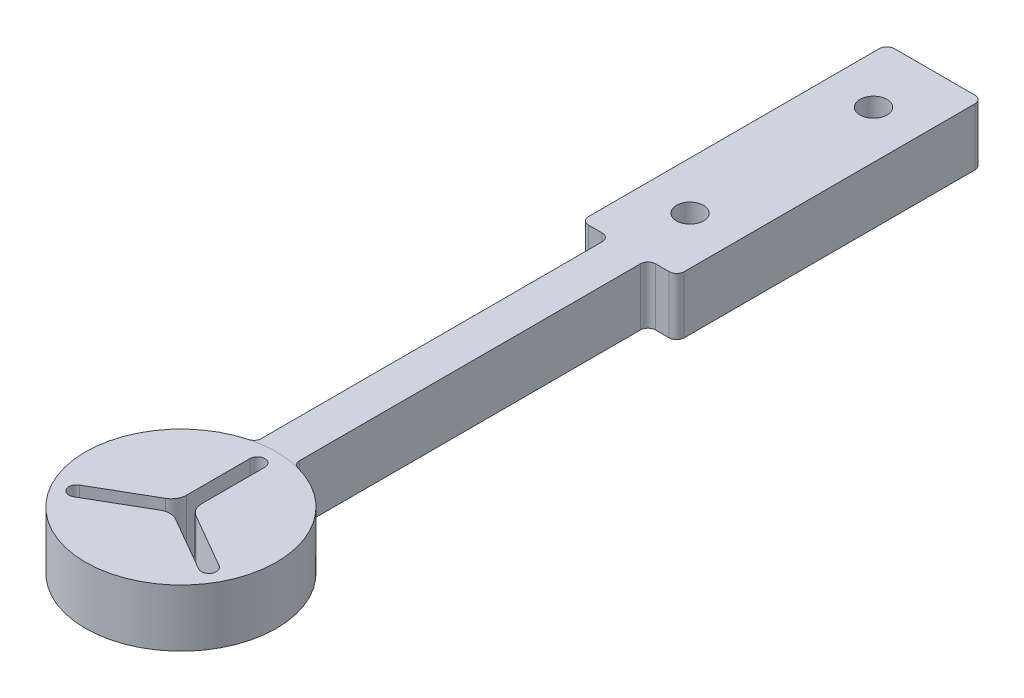
ISO-10303-21;
HEADER;
FILE_DESCRIPTION(('STEP AP214'),'2;1');
FILE_NAME('part.step','',(''),(''),'','','');
FILE_SCHEMA(('AUTOMOTIVE_DESIGN { 1 0 10303 214 1 1 1 1 }'));
ENDSEC;
DATA;
#1=APPLICATION_CONTEXT('core data for automotive mechanical design processes');
#2=APPLICATION_PROTOCOL_DEFINITION('international standard','automotive_design',2000,#1);
#3=PRODUCT_CONTEXT('',#1,'mechanical');
#4=PRODUCT('Part','Part','',(#3));
#5=PRODUCT_RELATED_PRODUCT_CATEGORY('part','',(#4));
#6=PRODUCT_DEFINITION_FORMATION('','',#4);
#7=PRODUCT_DEFINITION_CONTEXT('part definition',#1,'design');
#8=PRODUCT_DEFINITION('design','',#6,#7);
#9=PRODUCT_DEFINITION_SHAPE('','',#8);
#10=(LENGTH_UNIT() NAMED_UNIT(*) SI_UNIT(.MILLI.,.METRE.));
#11=(NAMED_UNIT(*) PLANE_ANGLE_UNIT() SI_UNIT($,.RADIAN.));
#12=(NAMED_UNIT(*) SI_UNIT($,.STERADIAN.) SOLID_ANGLE_UNIT());
#13=UNCERTAINTY_MEASURE_WITH_UNIT(LENGTH_MEASURE(1.E-05),#10,'distance_accuracy_value','');
#14=(GEOMETRIC_REPRESENTATION_CONTEXT(3) GLOBAL_UNCERTAINTY_ASSIGNED_CONTEXT((#13)) GLOBAL_UNIT_ASSIGNED_CONTEXT((#10,
#11,#12)) REPRESENTATION_CONTEXT('',''));
#15=CARTESIAN_POINT('',(0.,0.,0.));
#16=DIRECTION('',(0.,0.,1.));
#17=DIRECTION('',(1.,0.,0.));
#18=AXIS2_PLACEMENT_3D('',#15,#16,#17);
#19=CARTESIAN_POINT('',(0.,9.525,74.422));
#20=DIRECTION('',(0.,1.,0.));
#21=DIRECTION('',(0.,0.,1.));
#22=AXIS2_PLACEMENT_3D('',#19,#20,#21);
#23=PLANE('',#22);
#24=CARTESIAN_POINT('',(0.,9.525,-40.64));
#25=DIRECTION('',(0.,1.,0.));
#26=DIRECTION('',(0.,0.,1.));
#27=AXIS2_PLACEMENT_3D('',#24,#25,#26);
#28=CIRCLE('',#27,2.2479);
#29=CARTESIAN_POINT('',(0.,9.525,-38.3921));
#30=VERTEX_POINT('',#29);
#31=EDGE_CURVE('E302',#30,#30,#28,.T.);
#32=ORIENTED_EDGE('',*,*,#31,.F.);
#33=EDGE_LOOP('',(#32));
#34=FACE_BOUND('',#33,.T.);
#35=CARTESIAN_POINT('',(0.,9.525,-10.16));
#36=DIRECTION('',(0.,1.,0.));
#37=DIRECTION('',(0.,0.,1.));
#38=AXIS2_PLACEMENT_3D('',#35,#36,#37);
#39=CIRCLE('',#38,2.2479);
#40=CARTESIAN_POINT('',(0.,9.525,-7.9121));
#41=VERTEX_POINT('',#40);
#42=EDGE_CURVE('E289',#41,#41,#39,.T.);
#43=ORIENTED_EDGE('',*,*,#42,.F.);
#44=EDGE_LOOP('',(#43));
#45=FACE_BOUND('',#44,.T.);
#46=CARTESIAN_POINT('',(-4.42499999999999,9.525,57.8785723019684));
#47=DIRECTION('',(0.,1.,0.));
#48=DIRECTION('',(0.,0.,1.));
#49=AXIS2_PLACEMENT_3D('',#46,#47,#48);
#50=CIRCLE('',#49,1.25);
#51=CARTESIAN_POINT('',(-3.17499999999999,9.525,57.8785723019684));
#52=VERTEX_POINT('',#51);
#53=CARTESIAN_POINT('',(-4.10200729927006,9.525,59.086121768978));
#54=VERTEX_POINT('',#53);
#55=EDGE_CURVE('E430',#52,#54,#50,.F.);
#56=ORIENTED_EDGE('',*,*,#55,.T.);
#57=CARTESIAN_POINT('',(0.,9.525,74.422));
#58=DIRECTION('',(0.,1.,0.));
#59=DIRECTION('',(0.,0.,1.));
#60=AXIS2_PLACEMENT_3D('',#57,#58,#59);
#61=CIRCLE('',#60,15.875);
#62=CARTESIAN_POINT('',(4.10200729927008,9.525,59.086121768978));
#63=VERTEX_POINT('',#62);
#64=EDGE_CURVE('E436',#54,#63,#61,.F.);
#65=ORIENTED_EDGE('',*,*,#64,.T.);
#66=CARTESIAN_POINT('',(4.42500000000001,9.525,57.8785723019684));
#67=DIRECTION('',(0.,1.,0.));
#68=DIRECTION('',(0.,0.,1.));
#69=AXIS2_PLACEMENT_3D('',#66,#67,#68);
#70=CIRCLE('',#69,1.25);
#71=CARTESIAN_POINT('',(3.17500000000001,9.525,57.8785723019684));
#72=VERTEX_POINT('',#71);
#73=EDGE_CURVE('E426',#63,#72,#70,.F.);
#74=ORIENTED_EDGE('',*,*,#73,.T.);
#75=DIRECTION('',(0.,0.,-1.));
#76=VECTOR('',#75,1.);
#77=CARTESIAN_POINT('',(3.175,9.525,0.));
#78=LINE('',#77,#76);
#79=CARTESIAN_POINT('',(3.175,9.525,1.25));
#80=VERTEX_POINT('',#79);
#81=EDGE_CURVE('E324',#72,#80,#78,.T.);
#82=ORIENTED_EDGE('',*,*,#81,.T.);
#83=CARTESIAN_POINT('',(4.425,9.525,1.25));
#84=DIRECTION('',(0.,1.,0.));
#85=DIRECTION('',(0.,0.,1.));
#86=AXIS2_PLACEMENT_3D('',#83,#84,#85);
#87=CIRCLE('',#86,1.25);
#88=CARTESIAN_POINT('',(4.425,9.525,0.));
#89=VERTEX_POINT('',#88);
#90=EDGE_CURVE('E422',#80,#89,#87,.F.);
#91=ORIENTED_EDGE('',*,*,#90,.T.);
#92=DIRECTION('',(1.,0.,0.));
#93=VECTOR('',#92,1.);
#94=CARTESIAN_POINT('',(3.175,9.525,0.));
#95=LINE('',#94,#93);
#96=CARTESIAN_POINT('',(6.6875,9.525,0.));
#97=VERTEX_POINT('',#96);
#98=EDGE_CURVE('E327',#89,#97,#95,.T.);
#99=ORIENTED_EDGE('',*,*,#98,.T.);
#100=CARTESIAN_POINT('',(6.6875,9.525,-1.25));
#101=DIRECTION('',(0.,1.,0.));
#102=DIRECTION('',(0.,0.,1.));
#103=AXIS2_PLACEMENT_3D('',#100,#101,#102);
#104=CIRCLE('',#103,1.25);
#105=CARTESIAN_POINT('',(7.9375,9.525,-1.25));
#106=VERTEX_POINT('',#105);
#107=EDGE_CURVE('E376',#97,#106,#104,.T.);
#108=ORIENTED_EDGE('',*,*,#107,.T.);
#109=DIRECTION('',(0.,0.,-1.));
#110=VECTOR('',#109,1.);
#111=CARTESIAN_POINT('',(7.9375,9.525,-50.8));
#112=LINE('',#111,#110);
#113=CARTESIAN_POINT('',(7.9375,9.525,-49.55));
#114=VERTEX_POINT('',#113);
#115=EDGE_CURVE('E330',#106,#114,#112,.T.);
#116=ORIENTED_EDGE('',*,*,#115,.T.);
#117=CARTESIAN_POINT('',(6.6875,9.525,-49.55));
#118=DIRECTION('',(0.,1.,0.));
#119=DIRECTION('',(0.,0.,1.));
#120=AXIS2_PLACEMENT_3D('',#117,#118,#119);
#121=CIRCLE('',#120,1.25);
#122=CARTESIAN_POINT('',(6.6875,9.525,-50.8));
#123=VERTEX_POINT('',#122);
#124=EDGE_CURVE('E382',#114,#123,#121,.T.);
#125=ORIENTED_EDGE('',*,*,#124,.T.);
#126=DIRECTION('',(-1.,0.,0.));
#127=VECTOR('',#126,1.);
#128=CARTESIAN_POINT('',(-7.9375,9.525,-50.8));
#129=LINE('',#128,#127);
#130=CARTESIAN_POINT('',(-6.6875,9.525,-50.8));
#131=VERTEX_POINT('',#130);
#132=EDGE_CURVE('E333',#123,#131,#129,.T.);
#133=ORIENTED_EDGE('',*,*,#132,.T.);
#134=CARTESIAN_POINT('',(-6.6875,9.525,-49.55));
#135=DIRECTION('',(0.,1.,0.));
#136=DIRECTION('',(0.,0.,1.));
#137=AXIS2_PLACEMENT_3D('',#134,#135,#136);
#138=CIRCLE('',#137,1.25);
#139=CARTESIAN_POINT('',(-7.9375,9.525,-49.55));
#140=VERTEX_POINT('',#139);
#141=EDGE_CURVE('E380',#131,#140,#138,.T.);
#142=ORIENTED_EDGE('',*,*,#141,.T.);
#143=DIRECTION('',(0.,0.,1.));
#144=VECTOR('',#143,1.);
#145=CARTESIAN_POINT('',(-7.9375,9.525,-50.8));
#146=LINE('',#145,#144);
#147=CARTESIAN_POINT('',(-7.93749999999999,9.525,-1.25));
#148=VERTEX_POINT('',#147);
#149=EDGE_CURVE('E311',#140,#148,#146,.T.);
#150=ORIENTED_EDGE('',*,*,#149,.T.);
#151=CARTESIAN_POINT('',(-6.68749999999999,9.525,-1.25));
#152=DIRECTION('',(0.,1.,0.));
#153=DIRECTION('',(0.,0.,1.));
#154=AXIS2_PLACEMENT_3D('',#151,#152,#153);
#155=CIRCLE('',#154,1.25);
#156=CARTESIAN_POINT('',(-6.68749999999999,9.525,0.));
#157=VERTEX_POINT('',#156);
#158=EDGE_CURVE('E378',#148,#157,#155,.T.);
#159=ORIENTED_EDGE('',*,*,#158,.T.);
#160=DIRECTION('',(1.,0.,0.));
#161=VECTOR('',#160,1.);
#162=CARTESIAN_POINT('',(-7.93749999999999,9.525,0.));
#163=LINE('',#162,#161);
#164=CARTESIAN_POINT('',(-4.425,9.525,0.));
#165=VERTEX_POINT('',#164);
#166=EDGE_CURVE('E314',#157,#165,#163,.T.);
#167=ORIENTED_EDGE('',*,*,#166,.T.);
#168=CARTESIAN_POINT('',(-4.425,9.525,1.25));
#169=DIRECTION('',(0.,1.,0.));
#170=DIRECTION('',(0.,0.,1.));
#171=AXIS2_PLACEMENT_3D('',#168,#169,#170);
#172=CIRCLE('',#171,1.25);
#173=CARTESIAN_POINT('',(-3.175,9.525,1.25));
#174=VERTEX_POINT('',#173);
#175=EDGE_CURVE('E418',#165,#174,#172,.F.);
#176=ORIENTED_EDGE('',*,*,#175,.T.);
#177=DIRECTION('',(0.,0.,1.));
#178=VECTOR('',#177,1.);
#179=CARTESIAN_POINT('',(-3.175,9.525,0.));
#180=LINE('',#179,#178);
#181=EDGE_CURVE('E318',#174,#52,#180,.T.);
#182=ORIENTED_EDGE('',*,*,#181,.T.);
#183=EDGE_LOOP('',(#56,#65,#74,#82,#91,#99,#108,#116,#125,#133,#142,#150,#159,#167,#176,#182));
#184=FACE_BOUND('',#183,.T.);
#185=ADVANCED_FACE('F39',(#34,#45,#184),#23,.T.);
#186=CARTESIAN_POINT('',(0.,0.,74.422));
#187=DIRECTION('',(0.,1.,0.));
#188=DIRECTION('',(0.,0.,1.));
#189=AXIS2_PLACEMENT_3D('',#186,#187,#188);
#190=PLANE('',#189);
#191=DIRECTION('',(0.866025403784443,0.,-0.499999999999992));
#192=VECTOR('',#191,1.);
#193=CARTESIAN_POINT('',(2.79615740284012E-13,0.,75.8591402900668));
#194=LINE('',#193,#192);
#195=CARTESIAN_POINT('',(-10.3762226280623,0.,81.8498552175501));
#196=VERTEX_POINT('',#195);
#197=CARTESIAN_POINT('',(-1.26999999999972,0.,76.5923751319376));
#198=VERTEX_POINT('',#197);
#199=EDGE_CURVE('E259',#196,#198,#194,.T.);
#200=ORIENTED_EDGE('',*,*,#199,.T.);
#201=CARTESIAN_POINT('',(2.55654872272082E-13,0.,78.7920796575501));
#202=DIRECTION('',(0.,1.,0.));
#203=DIRECTION('',(0.,0.,1.));
#204=AXIS2_PLACEMENT_3D('',#201,#202,#203);
#205=CIRCLE('',#204,2.54);
#206=CARTESIAN_POINT('',(1.27000000000026,0.,76.5923751319376));
#207=VERTEX_POINT('',#206);
#208=EDGE_CURVE('E452',#198,#207,#205,.F.);
#209=ORIENTED_EDGE('',*,*,#208,.T.);
#210=DIRECTION('',(0.866025403784436,0.,0.500000000000004));
#211=VECTOR('',#210,1.);
#212=CARTESIAN_POINT('',(2.79615740284012E-13,0.,75.8591402900668));
#213=LINE('',#212,#211);
#214=CARTESIAN_POINT('',(10.3762226280625,0.,81.8498552175501));
#215=VERTEX_POINT('',#214);
#216=EDGE_CURVE('E261',#207,#215,#213,.T.);
#217=ORIENTED_EDGE('',*,*,#216,.T.);
#218=CARTESIAN_POINT('',(10.9985226280625,0.,80.772));
#219=DIRECTION('',(0.,1.,0.));
#220=DIRECTION('',(0.,0.,-1.));
#221=AXIS2_PLACEMENT_3D('',#218,#219,#220);
#222=CIRCLE('',#221,1.2446);
#223=CARTESIAN_POINT('',(11.6208226280625,0.,79.6941447824499));
#224=VERTEX_POINT('',#223);
#225=EDGE_CURVE('E263',#215,#224,#222,.T.);
#226=ORIENTED_EDGE('',*,*,#225,.T.);
#227=DIRECTION('',(-0.866025403784436,0.,-0.500000000000005));
#228=VECTOR('',#227,1.);
#229=CARTESIAN_POINT('',(1.2446,0.,73.7034298549664));
#230=LINE('',#229,#228);
#231=CARTESIAN_POINT('',(2.51459999999998,0.,74.4366646968373));
#232=VERTEX_POINT('',#231);
#233=EDGE_CURVE('E246',#224,#232,#230,.T.);
#234=ORIENTED_EDGE('',*,*,#233,.T.);
#235=CARTESIAN_POINT('',(3.7846,0.,72.2369601712248));
#236=DIRECTION('',(0.,1.,0.));
#237=DIRECTION('',(0.,0.,1.));
#238=AXIS2_PLACEMENT_3D('',#235,#236,#237);
#239=CIRCLE('',#238,2.54);
#240=CARTESIAN_POINT('',(1.2446,0.,72.2369601712248));
#241=VERTEX_POINT('',#240);
#242=EDGE_CURVE('E231',#232,#241,#239,.F.);
#243=ORIENTED_EDGE('',*,*,#242,.T.);
#244=DIRECTION('',(0.,0.,-1.));
#245=VECTOR('',#244,1.);
#246=CARTESIAN_POINT('',(1.2446,0.,73.7034298549664));
#247=LINE('',#246,#245);
#248=CARTESIAN_POINT('',(1.2446,0.,61.722));
#249=VERTEX_POINT('',#248);
#250=EDGE_CURVE('E222',#241,#249,#247,.T.);
#251=ORIENTED_EDGE('',*,*,#250,.T.);
#252=CARTESIAN_POINT('',(0.,0.,61.722));
#253=DIRECTION('',(0.,1.,0.));
#254=DIRECTION('',(0.,0.,-1.));
#255=AXIS2_PLACEMENT_3D('',#252,#253,#254);
#256=CIRCLE('',#255,1.2446);
#257=CARTESIAN_POINT('',(-1.2446,0.,61.722));
#258=VERTEX_POINT('',#257);
#259=EDGE_CURVE('E228',#249,#258,#256,.T.);
#260=ORIENTED_EDGE('',*,*,#259,.T.);
#261=DIRECTION('',(0.,0.,1.));
#262=VECTOR('',#261,1.);
#263=CARTESIAN_POINT('',(-1.2446,0.,73.7034298549668));
#264=LINE('',#263,#262);
#265=CARTESIAN_POINT('',(-1.2446,0.,72.2369601712251));
#266=VERTEX_POINT('',#265);
#267=EDGE_CURVE('E250',#258,#266,#264,.T.);
#268=ORIENTED_EDGE('',*,*,#267,.T.);
#269=CARTESIAN_POINT('',(-3.7846,0.,72.2369601712251));
#270=DIRECTION('',(0.,1.,0.));
#271=DIRECTION('',(0.,0.,1.));
#272=AXIS2_PLACEMENT_3D('',#269,#270,#271);
#273=CIRCLE('',#272,2.54);
#274=CARTESIAN_POINT('',(-2.51460000000002,0.,74.4366646968376));
#275=VERTEX_POINT('',#274);
#276=EDGE_CURVE('E54',#266,#275,#273,.F.);
#277=ORIENTED_EDGE('',*,*,#276,.T.);
#278=DIRECTION('',(-0.866025403784443,0.,0.499999999999992));
#279=VECTOR('',#278,1.);
#280=CARTESIAN_POINT('',(-1.2446,0.,73.7034298549668));
#281=LINE('',#280,#279);
#282=CARTESIAN_POINT('',(-11.6208226280623,0.,79.6941447824499));
#283=VERTEX_POINT('',#282);
#284=EDGE_CURVE('E252',#275,#283,#281,.T.);
#285=ORIENTED_EDGE('',*,*,#284,.T.);
#286=CARTESIAN_POINT('',(-10.9985226280623,0.,80.772));
#287=DIRECTION('',(0.,1.,0.));
#288=DIRECTION('',(0.,0.,-1.));
#289=AXIS2_PLACEMENT_3D('',#286,#287,#288);
#290=CIRCLE('',#289,1.2446);
#291=EDGE_CURVE('E256',#283,#196,#290,.T.);
#292=ORIENTED_EDGE('',*,*,#291,.T.);
#293=EDGE_LOOP('',(#200,#209,#217,#226,#234,#243,#251,#260,#268,#277,#285,#292));
#294=FACE_BOUND('',#293,.T.);
#295=DIRECTION('',(-1.,0.,0.));
#296=VECTOR('',#295,1.);
#297=CARTESIAN_POINT('',(0.,0.,0.));
#298=LINE('',#297,#296);
#299=CARTESIAN_POINT('',(4.425,0.,0.));
#300=VERTEX_POINT('',#299);
#301=CARTESIAN_POINT('',(-4.425,0.,0.));
#302=VERTEX_POINT('',#301);
#303=EDGE_CURVE('E433',#300,#302,#298,.T.);
#304=ORIENTED_EDGE('',*,*,#303,.F.);
#305=CARTESIAN_POINT('',(4.425,0.,1.25));
#306=DIRECTION('',(0.,1.,0.));
#307=DIRECTION('',(0.,0.,1.));
#308=AXIS2_PLACEMENT_3D('',#305,#306,#307);
#309=CIRCLE('',#308,1.25);
#310=CARTESIAN_POINT('',(3.175,0.,1.25));
#311=VERTEX_POINT('',#310);
#312=EDGE_CURVE('E420',#300,#311,#309,.T.);
#313=ORIENTED_EDGE('',*,*,#312,.T.);
#314=DIRECTION('',(0.,0.,-1.));
#315=VECTOR('',#314,1.);
#316=CARTESIAN_POINT('',(3.175,0.,0.));
#317=LINE('',#316,#315);
#318=CARTESIAN_POINT('',(3.17500000000001,0.,57.8785723019684));
#319=VERTEX_POINT('',#318);
#320=EDGE_CURVE('E348',#319,#311,#317,.T.);
#321=ORIENTED_EDGE('',*,*,#320,.F.);
#322=CARTESIAN_POINT('',(4.42500000000001,0.,57.8785723019684));
#323=DIRECTION('',(0.,1.,0.));
#324=DIRECTION('',(0.,0.,1.));
#325=AXIS2_PLACEMENT_3D('',#322,#323,#324);
#326=CIRCLE('',#325,1.25);
#327=CARTESIAN_POINT('',(4.10200729927008,0.,59.086121768978));
#328=VERTEX_POINT('',#327);
#329=EDGE_CURVE('E424',#319,#328,#326,.T.);
#330=ORIENTED_EDGE('',*,*,#329,.T.);
#331=CARTESIAN_POINT('',(0.,0.,74.422));
#332=DIRECTION('',(0.,1.,0.));
#333=DIRECTION('',(0.,0.,1.));
#334=AXIS2_PLACEMENT_3D('',#331,#332,#333);
#335=CIRCLE('',#334,15.875);
#336=CARTESIAN_POINT('',(-4.10200729927006,0.,59.086121768978));
#337=VERTEX_POINT('',#336);
#338=EDGE_CURVE('E345',#337,#328,#335,.T.);
#339=ORIENTED_EDGE('',*,*,#338,.F.);
#340=CARTESIAN_POINT('',(-4.42499999999999,0.,57.8785723019684));
#341=DIRECTION('',(0.,1.,0.));
#342=DIRECTION('',(0.,0.,1.));
#343=AXIS2_PLACEMENT_3D('',#340,#341,#342);
#344=CIRCLE('',#343,1.25);
#345=CARTESIAN_POINT('',(-3.17499999999999,0.,57.8785723019684));
#346=VERTEX_POINT('',#345);
#347=EDGE_CURVE('E428',#337,#346,#344,.T.);
#348=ORIENTED_EDGE('',*,*,#347,.T.);
#349=DIRECTION('',(0.,0.,1.));
#350=VECTOR('',#349,1.);
#351=CARTESIAN_POINT('',(-3.175,0.,0.));
#352=LINE('',#351,#350);
#353=CARTESIAN_POINT('',(-3.175,0.,1.25));
#354=VERTEX_POINT('',#353);
#355=EDGE_CURVE('E342',#354,#346,#352,.T.);
#356=ORIENTED_EDGE('',*,*,#355,.F.);
#357=CARTESIAN_POINT('',(-4.425,0.,1.25));
#358=DIRECTION('',(0.,1.,0.));
#359=DIRECTION('',(0.,0.,1.));
#360=AXIS2_PLACEMENT_3D('',#357,#358,#359);
#361=CIRCLE('',#360,1.25);
#362=EDGE_CURVE('E415',#354,#302,#361,.T.);
#363=ORIENTED_EDGE('',*,*,#362,.T.);
#364=EDGE_LOOP('',(#304,#313,#321,#330,#339,#348,#356,#363));
#365=FACE_BOUND('',#364,.T.);
#366=ADVANCED_FACE('F225',(#294,#365),#190,.F.);
#367=CARTESIAN_POINT('',(-7.9375,9.525,-50.8));
#368=DIRECTION('',(1.,0.,0.));
#369=DIRECTION('',(0.,0.,-1.));
#370=AXIS2_PLACEMENT_3D('',#367,#368,#369);
#371=PLANE('',#370);
#372=ORIENTED_EDGE('',*,*,#149,.F.);
#373=DIRECTION('',(0.,-1.,0.));
#374=VECTOR('',#373,1.);
#375=CARTESIAN_POINT('',(-7.9375,9.525,-49.55));
#376=LINE('',#375,#374);
#377=CARTESIAN_POINT('',(-7.9375,0.,-49.55));
#378=VERTEX_POINT('',#377);
#379=EDGE_CURVE('E386',#140,#378,#376,.T.);
#380=ORIENTED_EDGE('',*,*,#379,.T.);
#381=DIRECTION('',(0.,0.,1.));
#382=VECTOR('',#381,1.);
#383=CARTESIAN_POINT('',(-7.9375,0.,-50.8));
#384=LINE('',#383,#382);
#385=CARTESIAN_POINT('',(-7.93749999999999,0.,-1.25));
#386=VERTEX_POINT('',#385);
#387=EDGE_CURVE('E308',#378,#386,#384,.T.);
#388=ORIENTED_EDGE('',*,*,#387,.T.);
#389=DIRECTION('',(0.,-1.,0.));
#390=VECTOR('',#389,1.);
#391=CARTESIAN_POINT('',(-7.93749999999999,9.525,-1.25));
#392=LINE('',#391,#390);
#393=EDGE_CURVE('E384',#386,#148,#392,.F.);
#394=ORIENTED_EDGE('',*,*,#393,.T.);
#395=EDGE_LOOP('',(#372,#380,#388,#394));
#396=FACE_BOUND('',#395,.T.);
#397=ADVANCED_FACE('F505',(#396),#371,.F.);
#398=CARTESIAN_POINT('',(-7.93749999999999,9.525,0.));
#399=DIRECTION('',(0.,0.,-1.));
#400=DIRECTION('',(-1.,0.,0.));
#401=AXIS2_PLACEMENT_3D('',#398,#399,#400);
#402=PLANE('',#401);
#403=ORIENTED_EDGE('',*,*,#166,.F.);
#404=DIRECTION('',(0.,-1.,0.));
#405=VECTOR('',#404,1.);
#406=CARTESIAN_POINT('',(-6.68749999999999,9.525,0.));
#407=LINE('',#406,#405);
#408=CARTESIAN_POINT('',(-6.68749999999999,0.,0.));
#409=VERTEX_POINT('',#408);
#410=EDGE_CURVE('E391',#157,#409,#407,.T.);
#411=ORIENTED_EDGE('',*,*,#410,.T.);
#412=DIRECTION('',(1.,0.,0.));
#413=VECTOR('',#412,1.);
#414=CARTESIAN_POINT('',(-7.93749999999999,0.,0.));
#415=LINE('',#414,#413);
#416=EDGE_CURVE('E339',#409,#302,#415,.T.);
#417=ORIENTED_EDGE('',*,*,#416,.T.);
#418=DIRECTION('',(0.,-1.,0.));
#419=VECTOR('',#418,1.);
#420=CARTESIAN_POINT('',(-4.425,9.525,0.));
#421=LINE('',#420,#419);
#422=EDGE_CURVE('E389',#302,#165,#421,.F.);
#423=ORIENTED_EDGE('',*,*,#422,.T.);
#424=EDGE_LOOP('',(#403,#411,#417,#423));
#425=FACE_BOUND('',#424,.T.);
#426=ADVANCED_FACE('F548',(#425),#402,.F.);
#427=CARTESIAN_POINT('',(-3.175,9.525,0.));
#428=DIRECTION('',(1.,0.,0.));
#429=DIRECTION('',(0.,0.,-1.));
#430=AXIS2_PLACEMENT_3D('',#427,#428,#429);
#431=PLANE('',#430);
#432=ORIENTED_EDGE('',*,*,#181,.F.);
#433=DIRECTION('',(0.,-1.,0.));
#434=VECTOR('',#433,1.);
#435=CARTESIAN_POINT('',(-3.175,0.,1.25));
#436=LINE('',#435,#434);
#437=EDGE_CURVE('E396',#174,#354,#436,.T.);
#438=ORIENTED_EDGE('',*,*,#437,.T.);
#439=ORIENTED_EDGE('',*,*,#355,.T.);
#440=DIRECTION('',(0.,1.,0.));
#441=VECTOR('',#440,1.);
#442=CARTESIAN_POINT('',(-3.17499999999999,9.525,57.8785723019684));
#443=LINE('',#442,#441);
#444=EDGE_CURVE('E394',#346,#52,#443,.T.);
#445=ORIENTED_EDGE('',*,*,#444,.T.);
#446=EDGE_LOOP('',(#432,#438,#439,#445));
#447=FACE_BOUND('',#446,.T.);
#448=ADVANCED_FACE('F538',(#447),#431,.F.);
#449=CARTESIAN_POINT('',(0.,9.525,74.422));
#450=DIRECTION('',(0.,-1.,0.));
#451=DIRECTION('',(0.,0.,-1.));
#452=AXIS2_PLACEMENT_3D('',#449,#450,#451);
#453=CYLINDRICAL_SURFACE('',#452,15.875);
#454=ORIENTED_EDGE('',*,*,#338,.T.);
#455=DIRECTION('',(0.,-1.,0.));
#456=VECTOR('',#455,1.);
#457=CARTESIAN_POINT('',(4.10200729927008,9.525,59.086121768978));
#458=LINE('',#457,#456);
#459=EDGE_CURVE('E412',#328,#63,#458,.F.);
#460=ORIENTED_EDGE('',*,*,#459,.T.);
#461=CARTESIAN_POINT('',(0.,9.525,74.422));
#462=DIRECTION('',(0.,1.,0.));
#463=DIRECTION('',(0.,0.,1.));
#464=AXIS2_PLACEMENT_3D('',#461,#462,#463);
#465=CIRCLE('',#464,15.875);
#466=EDGE_CURVE('E321',#54,#63,#465,.T.);
#467=ORIENTED_EDGE('',*,*,#466,.F.);
#468=DIRECTION('',(0.,-1.,0.));
#469=VECTOR('',#468,1.);
#470=CARTESIAN_POINT('',(-4.10200729927006,9.525,59.086121768978));
#471=LINE('',#470,#469);
#472=EDGE_CURVE('E409',#54,#337,#471,.T.);
#473=ORIENTED_EDGE('',*,*,#472,.T.);
#474=EDGE_LOOP('',(#454,#460,#467,#473));
#475=FACE_BOUND('',#474,.T.);
#476=ADVANCED_FACE('F532',(#475),#453,.T.);
#477=CARTESIAN_POINT('',(3.175,9.525,0.));
#478=DIRECTION('',(-1.,0.,0.));
#479=DIRECTION('',(0.,0.,1.));
#480=AXIS2_PLACEMENT_3D('',#477,#478,#479);
#481=PLANE('',#480);
#482=ORIENTED_EDGE('',*,*,#320,.T.);
#483=DIRECTION('',(0.,-1.,0.));
#484=VECTOR('',#483,1.);
#485=CARTESIAN_POINT('',(3.175,9.525,1.25));
#486=LINE('',#485,#484);
#487=EDGE_CURVE('E407',#311,#80,#486,.F.);
#488=ORIENTED_EDGE('',*,*,#487,.T.);
#489=ORIENTED_EDGE('',*,*,#81,.F.);
#490=DIRECTION('',(0.,1.,0.));
#491=VECTOR('',#490,1.);
#492=CARTESIAN_POINT('',(3.17500000000001,0.,57.8785723019684));
#493=LINE('',#492,#491);
#494=EDGE_CURVE('E404',#72,#319,#493,.F.);
#495=ORIENTED_EDGE('',*,*,#494,.T.);
#496=EDGE_LOOP('',(#482,#488,#489,#495));
#497=FACE_BOUND('',#496,.T.);
#498=ADVANCED_FACE('F801',(#497),#481,.F.);
#499=CARTESIAN_POINT('',(3.175,9.525,0.));
#500=DIRECTION('',(0.,0.,-1.));
#501=DIRECTION('',(-1.,0.,0.));
#502=AXIS2_PLACEMENT_3D('',#499,#500,#501);
#503=PLANE('',#502);
#504=DIRECTION('',(1.,0.,0.));
#505=VECTOR('',#504,1.);
#506=CARTESIAN_POINT('',(3.175,0.,0.));
#507=LINE('',#506,#505);
#508=CARTESIAN_POINT('',(6.6875,0.,0.));
#509=VERTEX_POINT('',#508);
#510=EDGE_CURVE('E351',#300,#509,#507,.T.);
#511=ORIENTED_EDGE('',*,*,#510,.T.);
#512=DIRECTION('',(0.,-1.,0.));
#513=VECTOR('',#512,1.);
#514=CARTESIAN_POINT('',(6.6875,9.525,0.));
#515=LINE('',#514,#513);
#516=EDGE_CURVE('E402',#509,#97,#515,.F.);
#517=ORIENTED_EDGE('',*,*,#516,.T.);
#518=ORIENTED_EDGE('',*,*,#98,.F.);
#519=DIRECTION('',(0.,-1.,0.));
#520=VECTOR('',#519,1.);
#521=CARTESIAN_POINT('',(4.425,0.,0.));
#522=LINE('',#521,#520);
#523=EDGE_CURVE('E399',#89,#300,#522,.T.);
#524=ORIENTED_EDGE('',*,*,#523,.T.);
#525=EDGE_LOOP('',(#511,#517,#518,#524));
#526=FACE_BOUND('',#525,.T.);
#527=ADVANCED_FACE('F556',(#526),#503,.F.);
#528=CARTESIAN_POINT('',(7.9375,9.525,-50.8));
#529=DIRECTION('',(-1.,0.,0.));
#530=DIRECTION('',(0.,0.,1.));
#531=AXIS2_PLACEMENT_3D('',#528,#529,#530);
#532=PLANE('',#531);
#533=DIRECTION('',(0.,0.,-1.));
#534=VECTOR('',#533,1.);
#535=CARTESIAN_POINT('',(7.9375,0.,-50.8));
#536=LINE('',#535,#534);
#537=CARTESIAN_POINT('',(7.9375,0.,-1.25));
#538=VERTEX_POINT('',#537);
#539=CARTESIAN_POINT('',(7.9375,0.,-49.55));
#540=VERTEX_POINT('',#539);
#541=EDGE_CURVE('E354',#538,#540,#536,.T.);
#542=ORIENTED_EDGE('',*,*,#541,.T.);
#543=DIRECTION('',(0.,-1.,0.));
#544=VECTOR('',#543,1.);
#545=CARTESIAN_POINT('',(7.9375,9.525,-49.55));
#546=LINE('',#545,#544);
#547=EDGE_CURVE('E374',#540,#114,#546,.F.);
#548=ORIENTED_EDGE('',*,*,#547,.T.);
#549=ORIENTED_EDGE('',*,*,#115,.F.);
#550=DIRECTION('',(0.,-1.,0.));
#551=VECTOR('',#550,1.);
#552=CARTESIAN_POINT('',(7.9375,9.525,-1.25));
#553=LINE('',#552,#551);
#554=EDGE_CURVE('E371',#106,#538,#553,.T.);
#555=ORIENTED_EDGE('',*,*,#554,.T.);
#556=EDGE_LOOP('',(#542,#548,#549,#555));
#557=FACE_BOUND('',#556,.T.);
#558=ADVANCED_FACE('F520',(#557),#532,.F.);
#559=CARTESIAN_POINT('',(-7.9375,9.525,-50.8));
#560=DIRECTION('',(0.,0.,1.));
#561=DIRECTION('',(1.,0.,0.));
#562=AXIS2_PLACEMENT_3D('',#559,#560,#561);
#563=PLANE('',#562);
#564=ORIENTED_EDGE('',*,*,#132,.F.);
#565=DIRECTION('',(0.,-1.,0.));
#566=VECTOR('',#565,1.);
#567=CARTESIAN_POINT('',(6.6875,9.525,-50.8));
#568=LINE('',#567,#566);
#569=CARTESIAN_POINT('',(6.6875,0.,-50.8));
#570=VERTEX_POINT('',#569);
#571=EDGE_CURVE('E360',#123,#570,#568,.T.);
#572=ORIENTED_EDGE('',*,*,#571,.T.);
#573=DIRECTION('',(-1.,0.,0.));
#574=VECTOR('',#573,1.);
#575=CARTESIAN_POINT('',(-7.9375,0.,-50.8));
#576=LINE('',#575,#574);
#577=CARTESIAN_POINT('',(-6.6875,0.,-50.8));
#578=VERTEX_POINT('',#577);
#579=EDGE_CURVE('E315',#570,#578,#576,.T.);
#580=ORIENTED_EDGE('',*,*,#579,.T.);
#581=DIRECTION('',(0.,-1.,0.));
#582=VECTOR('',#581,1.);
#583=CARTESIAN_POINT('',(-6.6875,9.525,-50.8));
#584=LINE('',#583,#582);
#585=EDGE_CURVE('E336',#578,#131,#584,.F.);
#586=ORIENTED_EDGE('',*,*,#585,.T.);
#587=EDGE_LOOP('',(#564,#572,#580,#586));
#588=FACE_BOUND('',#587,.T.);
#589=ADVANCED_FACE('F512',(#588),#563,.F.);
#590=ORIENTED_EDGE('',*,*,#64,.F.);
#591=ORIENTED_EDGE('',*,*,#466,.T.);
#592=EDGE_LOOP('',(#590,#591));
#593=FACE_BOUND('',#592,.T.);
#594=DIRECTION('',(0.866025403784436,0.,0.500000000000004));
#595=VECTOR('',#594,1.);
#596=CARTESIAN_POINT('',(2.79615740284012E-13,9.525,75.8591402900668));
#597=LINE('',#596,#595);
#598=CARTESIAN_POINT('',(1.27000000000026,9.525,76.5923751319376));
#599=VERTEX_POINT('',#598);
#600=CARTESIAN_POINT('',(10.3762226280625,9.525,81.8498552175501));
#601=VERTEX_POINT('',#600);
#602=EDGE_CURVE('E280',#599,#601,#597,.T.);
#603=ORIENTED_EDGE('',*,*,#602,.F.);
#604=CARTESIAN_POINT('',(2.55654872272082E-13,9.525,78.7920796575501));
#605=DIRECTION('',(0.,1.,0.));
#606=DIRECTION('',(0.,0.,1.));
#607=AXIS2_PLACEMENT_3D('',#604,#605,#606);
#608=CIRCLE('',#607,2.54);
#609=CARTESIAN_POINT('',(-1.26999999999972,9.525,76.5923751319376));
#610=VERTEX_POINT('',#609);
#611=EDGE_CURVE('E446',#599,#610,#608,.T.);
#612=ORIENTED_EDGE('',*,*,#611,.T.);
#613=DIRECTION('',(0.866025403784443,0.,-0.499999999999992));
#614=VECTOR('',#613,1.);
#615=CARTESIAN_POINT('',(2.79615740284012E-13,9.525,75.8591402900668));
#616=LINE('',#615,#614);
#617=CARTESIAN_POINT('',(-10.3762226280623,9.525,81.8498552175501));
#618=VERTEX_POINT('',#617);
#619=EDGE_CURVE('E277',#618,#610,#616,.T.);
#620=ORIENTED_EDGE('',*,*,#619,.F.);
#621=CARTESIAN_POINT('',(-10.9985226280623,9.525,80.772));
#622=DIRECTION('',(0.,1.,0.));
#623=DIRECTION('',(0.,0.,-1.));
#624=AXIS2_PLACEMENT_3D('',#621,#622,#623);
#625=CIRCLE('',#624,1.2446);
#626=CARTESIAN_POINT('',(-11.6208226280623,9.525,79.6941447824499));
#627=VERTEX_POINT('',#626);
#628=EDGE_CURVE('E274',#627,#618,#625,.T.);
#629=ORIENTED_EDGE('',*,*,#628,.F.);
#630=DIRECTION('',(-0.866025403784443,0.,0.499999999999992));
#631=VECTOR('',#630,1.);
#632=CARTESIAN_POINT('',(-1.2446,9.525,73.7034298549668));
#633=LINE('',#632,#631);
#634=CARTESIAN_POINT('',(-2.51460000000002,9.525,74.4366646968376));
#635=VERTEX_POINT('',#634);
#636=EDGE_CURVE('E272',#635,#627,#633,.T.);
#637=ORIENTED_EDGE('',*,*,#636,.F.);
#638=CARTESIAN_POINT('',(-3.7846,9.525,72.2369601712251));
#639=DIRECTION('',(0.,1.,0.));
#640=DIRECTION('',(0.,0.,1.));
#641=AXIS2_PLACEMENT_3D('',#638,#639,#640);
#642=CIRCLE('',#641,2.54);
#643=CARTESIAN_POINT('',(-1.2446,9.525,72.2369601712251));
#644=VERTEX_POINT('',#643);
#645=EDGE_CURVE('E442',#635,#644,#642,.T.);
#646=ORIENTED_EDGE('',*,*,#645,.T.);
#647=DIRECTION('',(0.,0.,1.));
#648=VECTOR('',#647,1.);
#649=CARTESIAN_POINT('',(-1.2446,9.525,73.7034298549668));
#650=LINE('',#649,#648);
#651=CARTESIAN_POINT('',(-1.2446,9.525,61.722));
#652=VERTEX_POINT('',#651);
#653=EDGE_CURVE('E270',#652,#644,#650,.T.);
#654=ORIENTED_EDGE('',*,*,#653,.F.);
#655=CARTESIAN_POINT('',(0.,9.525,61.722));
#656=DIRECTION('',(0.,1.,0.));
#657=DIRECTION('',(0.,0.,-1.));
#658=AXIS2_PLACEMENT_3D('',#655,#656,#657);
#659=CIRCLE('',#658,1.2446);
#660=CARTESIAN_POINT('',(1.2446,9.525,61.722));
#661=VERTEX_POINT('',#660);
#662=EDGE_CURVE('E268',#661,#652,#659,.T.);
#663=ORIENTED_EDGE('',*,*,#662,.F.);
#664=DIRECTION('',(0.,0.,-1.));
#665=VECTOR('',#664,1.);
#666=CARTESIAN_POINT('',(1.2446,9.525,73.7034298549664));
#667=LINE('',#666,#665);
#668=CARTESIAN_POINT('',(1.2446,9.525,72.2369601712248));
#669=VERTEX_POINT('',#668);
#670=EDGE_CURVE('E241',#669,#661,#667,.T.);
#671=ORIENTED_EDGE('',*,*,#670,.F.);
#672=CARTESIAN_POINT('',(3.7846,9.525,72.2369601712248));
#673=DIRECTION('',(0.,1.,0.));
#674=DIRECTION('',(0.,0.,1.));
#675=AXIS2_PLACEMENT_3D('',#672,#673,#674);
#676=CIRCLE('',#675,2.54);
#677=CARTESIAN_POINT('',(2.51459999999998,9.525,74.4366646968373));
#678=VERTEX_POINT('',#677);
#679=EDGE_CURVE('E444',#669,#678,#676,.T.);
#680=ORIENTED_EDGE('',*,*,#679,.T.);
#681=DIRECTION('',(-0.866025403784436,0.,-0.500000000000005));
#682=VECTOR('',#681,1.);
#683=CARTESIAN_POINT('',(1.2446,9.525,73.7034298549664));
#684=LINE('',#683,#682);
#685=CARTESIAN_POINT('',(11.6208226280625,9.525,79.6941447824499));
#686=VERTEX_POINT('',#685);
#687=EDGE_CURVE('E235',#686,#678,#684,.T.);
#688=ORIENTED_EDGE('',*,*,#687,.F.);
#689=CARTESIAN_POINT('',(10.9985226280625,9.525,80.772));
#690=DIRECTION('',(0.,1.,0.));
#691=DIRECTION('',(0.,0.,-1.));
#692=AXIS2_PLACEMENT_3D('',#689,#690,#691);
#693=CIRCLE('',#692,1.2446);
#694=EDGE_CURVE('E282',#601,#686,#693,.T.);
#695=ORIENTED_EDGE('',*,*,#694,.F.);
#696=EDGE_LOOP('',(#603,#612,#620,#629,#637,#646,#654,#663,#671,#680,#688,#695));
#697=FACE_BOUND('',#696,.T.);
#698=ADVANCED_FACE('F467',(#593,#697),#23,.T.);
#699=CARTESIAN_POINT('',(0.,0.,-10.16));
#700=DIRECTION('',(0.,1.,0.));
#701=DIRECTION('',(0.,0.,1.));
#702=AXIS2_PLACEMENT_3D('',#699,#700,#701);
#703=CIRCLE('',#702,2.2479);
#704=CARTESIAN_POINT('',(0.,0.,-7.9121));
#705=VERTEX_POINT('',#704);
#706=EDGE_CURVE('E299',#705,#705,#703,.T.);
#707=ORIENTED_EDGE('',*,*,#706,.T.);
#708=EDGE_LOOP('',(#707));
#709=FACE_BOUND('',#708,.T.);
#710=CARTESIAN_POINT('',(0.,0.,-40.64));
#711=DIRECTION('',(0.,1.,0.));
#712=DIRECTION('',(0.,0.,1.));
#713=AXIS2_PLACEMENT_3D('',#710,#711,#712);
#714=CIRCLE('',#713,2.2479);
#715=CARTESIAN_POINT('',(0.,0.,-38.3921));
#716=VERTEX_POINT('',#715);
#717=EDGE_CURVE('E305',#716,#716,#714,.T.);
#718=ORIENTED_EDGE('',*,*,#717,.T.);
#719=EDGE_LOOP('',(#718));
#720=FACE_BOUND('',#719,.T.);
#721=ORIENTED_EDGE('',*,*,#510,.F.);
#722=ORIENTED_EDGE('',*,*,#303,.T.);
#723=ORIENTED_EDGE('',*,*,#416,.F.);
#724=CARTESIAN_POINT('',(-6.68749999999999,0.,-1.25));
#725=DIRECTION('',(0.,1.,0.));
#726=DIRECTION('',(0.,0.,1.));
#727=AXIS2_PLACEMENT_3D('',#724,#725,#726);
#728=CIRCLE('',#727,1.25);
#729=EDGE_CURVE('E365',#409,#386,#728,.F.);
#730=ORIENTED_EDGE('',*,*,#729,.T.);
#731=ORIENTED_EDGE('',*,*,#387,.F.);
#732=CARTESIAN_POINT('',(-6.6875,0.,-49.55));
#733=DIRECTION('',(0.,1.,0.));
#734=DIRECTION('',(0.,0.,1.));
#735=AXIS2_PLACEMENT_3D('',#732,#733,#734);
#736=CIRCLE('',#735,1.25);
#737=EDGE_CURVE('E367',#378,#578,#736,.F.);
#738=ORIENTED_EDGE('',*,*,#737,.T.);
#739=ORIENTED_EDGE('',*,*,#579,.F.);
#740=CARTESIAN_POINT('',(6.6875,0.,-49.55));
#741=DIRECTION('',(0.,1.,0.));
#742=DIRECTION('',(0.,0.,1.));
#743=AXIS2_PLACEMENT_3D('',#740,#741,#742);
#744=CIRCLE('',#743,1.25);
#745=EDGE_CURVE('E369',#570,#540,#744,.F.);
#746=ORIENTED_EDGE('',*,*,#745,.T.);
#747=ORIENTED_EDGE('',*,*,#541,.F.);
#748=CARTESIAN_POINT('',(6.6875,0.,-1.25));
#749=DIRECTION('',(0.,1.,0.));
#750=DIRECTION('',(0.,0.,1.));
#751=AXIS2_PLACEMENT_3D('',#748,#749,#750);
#752=CIRCLE('',#751,1.25);
#753=EDGE_CURVE('E363',#538,#509,#752,.F.);
#754=ORIENTED_EDGE('',*,*,#753,.T.);
#755=EDGE_LOOP('',(#721,#722,#723,#730,#731,#738,#739,#746,#747,#754));
#756=FACE_BOUND('',#755,.T.);
#757=ADVANCED_FACE('F507',(#709,#720,#756),#190,.F.);
#758=CARTESIAN_POINT('',(0.,0.,-40.64));
#759=DIRECTION('',(0.,1.,0.));
#760=DIRECTION('',(0.,0.,1.));
#761=AXIS2_PLACEMENT_3D('',#758,#759,#760);
#762=CYLINDRICAL_SURFACE('',#761,2.2479);
#763=ORIENTED_EDGE('',*,*,#717,.F.);
#764=EDGE_LOOP('',(#763));
#765=FACE_BOUND('',#764,.T.);
#766=ORIENTED_EDGE('',*,*,#31,.T.);
#767=EDGE_LOOP('',(#766));
#768=FACE_BOUND('',#767,.T.);
#769=ADVANCED_FACE('F518',(#765,#768),#762,.F.);
#770=CARTESIAN_POINT('',(0.,0.,-10.16));
#771=DIRECTION('',(0.,1.,0.));
#772=DIRECTION('',(0.,0.,1.));
#773=AXIS2_PLACEMENT_3D('',#770,#771,#772);
#774=CYLINDRICAL_SURFACE('',#773,2.2479);
#775=ORIENTED_EDGE('',*,*,#706,.F.);
#776=EDGE_LOOP('',(#775));
#777=FACE_BOUND('',#776,.T.);
#778=ORIENTED_EDGE('',*,*,#42,.T.);
#779=EDGE_LOOP('',(#778));
#780=FACE_BOUND('',#779,.T.);
#781=ADVANCED_FACE('F642',(#777,#780),#774,.F.);
#782=CARTESIAN_POINT('',(1.2446,0.,73.7034298549664));
#783=DIRECTION('',(1.,0.,0.));
#784=DIRECTION('',(0.,0.,-1.));
#785=AXIS2_PLACEMENT_3D('',#782,#783,#784);
#786=PLANE('',#785);
#787=ORIENTED_EDGE('',*,*,#250,.F.);
#788=DIRECTION('',(0.,1.,0.));
#789=VECTOR('',#788,1.);
#790=CARTESIAN_POINT('',(1.2446,0.,72.2369601712248));
#791=LINE('',#790,#789);
#792=EDGE_CURVE('E454',#241,#669,#791,.T.);
#793=ORIENTED_EDGE('',*,*,#792,.T.);
#794=ORIENTED_EDGE('',*,*,#670,.T.);
#795=DIRECTION('',(0.,1.,0.));
#796=VECTOR('',#795,1.);
#797=CARTESIAN_POINT('',(1.2446,0.,61.722));
#798=LINE('',#797,#796);
#799=EDGE_CURVE('E238',#249,#661,#798,.T.);
#800=ORIENTED_EDGE('',*,*,#799,.F.);
#801=EDGE_LOOP('',(#787,#793,#794,#800));
#802=FACE_BOUND('',#801,.T.);
#803=ADVANCED_FACE('F239',(#802),#786,.F.);
#804=CARTESIAN_POINT('',(1.2446,0.,73.7034298549664));
#805=DIRECTION('',(0.500000000000005,0.,-0.866025403784436));
#806=DIRECTION('',(-0.866025403784436,0.,-0.500000000000005));
#807=AXIS2_PLACEMENT_3D('',#804,#805,#806);
#808=PLANE('',#807);
#809=ORIENTED_EDGE('',*,*,#687,.T.);
#810=DIRECTION('',(0.,1.,0.));
#811=VECTOR('',#810,1.);
#812=CARTESIAN_POINT('',(2.51459999999999,0.,74.4366646968373));
#813=LINE('',#812,#811);
#814=EDGE_CURVE('E456',#678,#232,#813,.F.);
#815=ORIENTED_EDGE('',*,*,#814,.T.);
#816=ORIENTED_EDGE('',*,*,#233,.F.);
#817=DIRECTION('',(0.,1.,0.));
#818=VECTOR('',#817,1.);
#819=CARTESIAN_POINT('',(11.6208226280625,0.,79.6941447824499));
#820=LINE('',#819,#818);
#821=EDGE_CURVE('E287',#224,#686,#820,.T.);
#822=ORIENTED_EDGE('',*,*,#821,.T.);
#823=EDGE_LOOP('',(#809,#815,#816,#822));
#824=FACE_BOUND('',#823,.T.);
#825=ADVANCED_FACE('F641',(#824),#808,.F.);
#826=CARTESIAN_POINT('',(10.9985226280625,0.,80.772));
#827=DIRECTION('',(0.,1.,0.));
#828=DIRECTION('',(0.,0.,1.));
#829=AXIS2_PLACEMENT_3D('',#826,#827,#828);
#830=CYLINDRICAL_SURFACE('',#829,1.2446);
#831=ORIENTED_EDGE('',*,*,#694,.T.);
#832=ORIENTED_EDGE('',*,*,#821,.F.);
#833=ORIENTED_EDGE('',*,*,#225,.F.);
#834=DIRECTION('',(0.,1.,0.));
#835=VECTOR('',#834,1.);
#836=CARTESIAN_POINT('',(10.3762226280625,0.,81.8498552175501));
#837=LINE('',#836,#835);
#838=EDGE_CURVE('E290',#215,#601,#837,.T.);
#839=ORIENTED_EDGE('',*,*,#838,.T.);
#840=EDGE_LOOP('',(#831,#832,#833,#839));
#841=FACE_BOUND('',#840,.T.);
#842=ADVANCED_FACE('F487',(#841),#830,.F.);
#843=CARTESIAN_POINT('',(2.79615740284012E-13,0.,75.8591402900668));
#844=DIRECTION('',(-0.500000000000004,0.,0.866025403784436));
#845=DIRECTION('',(0.866025403784436,0.,0.500000000000004));
#846=AXIS2_PLACEMENT_3D('',#843,#844,#845);
#847=PLANE('',#846);
#848=ORIENTED_EDGE('',*,*,#216,.F.);
#849=DIRECTION('',(0.,1.,0.));
#850=VECTOR('',#849,1.);
#851=CARTESIAN_POINT('',(1.27000000000026,0.,76.5923751319376));
#852=LINE('',#851,#850);
#853=EDGE_CURVE('E439',#207,#599,#852,.T.);
#854=ORIENTED_EDGE('',*,*,#853,.T.);
#855=ORIENTED_EDGE('',*,*,#602,.T.);
#856=ORIENTED_EDGE('',*,*,#838,.F.);
#857=EDGE_LOOP('',(#848,#854,#855,#856));
#858=FACE_BOUND('',#857,.T.);
#859=ADVANCED_FACE('F482',(#858),#847,.F.);
#860=CARTESIAN_POINT('',(2.79615740284012E-13,0.,75.8591402900668));
#861=DIRECTION('',(0.499999999999992,0.,0.866025403784443));
#862=DIRECTION('',(0.866025403784443,0.,-0.499999999999992));
#863=AXIS2_PLACEMENT_3D('',#860,#861,#862);
#864=PLANE('',#863);
#865=ORIENTED_EDGE('',*,*,#619,.T.);
#866=DIRECTION('',(0.,1.,0.));
#867=VECTOR('',#866,1.);
#868=CARTESIAN_POINT('',(-1.26999999999972,0.,76.5923751319376));
#869=LINE('',#868,#867);
#870=EDGE_CURVE('E448',#610,#198,#869,.F.);
#871=ORIENTED_EDGE('',*,*,#870,.T.);
#872=ORIENTED_EDGE('',*,*,#199,.F.);
#873=DIRECTION('',(0.,1.,0.));
#874=VECTOR('',#873,1.);
#875=CARTESIAN_POINT('',(-10.3762226280623,0.,81.8498552175501));
#876=LINE('',#875,#874);
#877=EDGE_CURVE('E293',#196,#618,#876,.T.);
#878=ORIENTED_EDGE('',*,*,#877,.T.);
#879=EDGE_LOOP('',(#865,#871,#872,#878));
#880=FACE_BOUND('',#879,.T.);
#881=ADVANCED_FACE('F663',(#880),#864,.F.);
#882=CARTESIAN_POINT('',(-10.9985226280623,0.,80.772));
#883=DIRECTION('',(0.,1.,0.));
#884=DIRECTION('',(0.,0.,1.));
#885=AXIS2_PLACEMENT_3D('',#882,#883,#884);
#886=CYLINDRICAL_SURFACE('',#885,1.2446);
#887=ORIENTED_EDGE('',*,*,#628,.T.);
#888=ORIENTED_EDGE('',*,*,#877,.F.);
#889=ORIENTED_EDGE('',*,*,#291,.F.);
#890=DIRECTION('',(0.,1.,0.));
#891=VECTOR('',#890,1.);
#892=CARTESIAN_POINT('',(-11.6208226280623,0.,79.6941447824499));
#893=LINE('',#892,#891);
#894=EDGE_CURVE('E295',#283,#627,#893,.T.);
#895=ORIENTED_EDGE('',*,*,#894,.T.);
#896=EDGE_LOOP('',(#887,#888,#889,#895));
#897=FACE_BOUND('',#896,.T.);
#898=ADVANCED_FACE('F471',(#897),#886,.F.);
#899=CARTESIAN_POINT('',(-1.2446,0.,73.7034298549668));
#900=DIRECTION('',(-0.499999999999992,0.,-0.866025403784443));
#901=DIRECTION('',(-0.866025403784443,0.,0.499999999999992));
#902=AXIS2_PLACEMENT_3D('',#899,#900,#901);
#903=PLANE('',#902);
#904=ORIENTED_EDGE('',*,*,#284,.F.);
#905=DIRECTION('',(0.,1.,0.));
#906=VECTOR('',#905,1.);
#907=CARTESIAN_POINT('',(-2.51460000000002,0.,74.4366646968376));
#908=LINE('',#907,#906);
#909=EDGE_CURVE('E47',#275,#635,#908,.T.);
#910=ORIENTED_EDGE('',*,*,#909,.T.);
#911=ORIENTED_EDGE('',*,*,#636,.T.);
#912=ORIENTED_EDGE('',*,*,#894,.F.);
#913=EDGE_LOOP('',(#904,#910,#911,#912));
#914=FACE_BOUND('',#913,.T.);
#915=ADVANCED_FACE('F461',(#914),#903,.F.);
#916=CARTESIAN_POINT('',(-1.2446,0.,73.7034298549668));
#917=DIRECTION('',(-1.,0.,0.));
#918=DIRECTION('',(0.,0.,1.));
#919=AXIS2_PLACEMENT_3D('',#916,#917,#918);
#920=PLANE('',#919);
#921=ORIENTED_EDGE('',*,*,#653,.T.);
#922=DIRECTION('',(0.,1.,0.));
#923=VECTOR('',#922,1.);
#924=CARTESIAN_POINT('',(-1.2446,0.,72.2369601712251));
#925=LINE('',#924,#923);
#926=EDGE_CURVE('E11',#644,#266,#925,.F.);
#927=ORIENTED_EDGE('',*,*,#926,.T.);
#928=ORIENTED_EDGE('',*,*,#267,.F.);
#929=DIRECTION('',(0.,1.,0.));
#930=VECTOR('',#929,1.);
#931=CARTESIAN_POINT('',(-1.2446,0.,61.722));
#932=LINE('',#931,#930);
#933=EDGE_CURVE('E245',#258,#652,#932,.T.);
#934=ORIENTED_EDGE('',*,*,#933,.T.);
#935=EDGE_LOOP('',(#921,#927,#928,#934));
#936=FACE_BOUND('',#935,.T.);
#937=ADVANCED_FACE('F494',(#936),#920,.F.);
#938=CARTESIAN_POINT('',(0.,0.,61.722));
#939=DIRECTION('',(0.,1.,0.));
#940=DIRECTION('',(0.,0.,1.));
#941=AXIS2_PLACEMENT_3D('',#938,#939,#940);
#942=CYLINDRICAL_SURFACE('',#941,1.2446);
#943=ORIENTED_EDGE('',*,*,#662,.T.);
#944=ORIENTED_EDGE('',*,*,#933,.F.);
#945=ORIENTED_EDGE('',*,*,#259,.F.);
#946=ORIENTED_EDGE('',*,*,#799,.T.);
#947=EDGE_LOOP('',(#943,#944,#945,#946));
#948=FACE_BOUND('',#947,.T.);
#949=ADVANCED_FACE('F249',(#948),#942,.F.);
#950=CARTESIAN_POINT('',(6.6875,9.525,-49.55));
#951=DIRECTION('',(0.,-1.,0.));
#952=DIRECTION('',(0.,0.,-1.));
#953=AXIS2_PLACEMENT_3D('',#950,#951,#952);
#954=CYLINDRICAL_SURFACE('',#953,1.25);
#955=ORIENTED_EDGE('',*,*,#124,.F.);
#956=ORIENTED_EDGE('',*,*,#547,.F.);
#957=ORIENTED_EDGE('',*,*,#745,.F.);
#958=ORIENTED_EDGE('',*,*,#571,.F.);
#959=EDGE_LOOP('',(#955,#956,#957,#958));
#960=FACE_BOUND('',#959,.T.);
#961=ADVANCED_FACE('F568',(#960),#954,.T.);
#962=CARTESIAN_POINT('',(-6.6875,9.525,-49.55));
#963=DIRECTION('',(0.,-1.,0.));
#964=DIRECTION('',(0.,0.,-1.));
#965=AXIS2_PLACEMENT_3D('',#962,#963,#964);
#966=CYLINDRICAL_SURFACE('',#965,1.25);
#967=ORIENTED_EDGE('',*,*,#141,.F.);
#968=ORIENTED_EDGE('',*,*,#585,.F.);
#969=ORIENTED_EDGE('',*,*,#737,.F.);
#970=ORIENTED_EDGE('',*,*,#379,.F.);
#971=EDGE_LOOP('',(#967,#968,#969,#970));
#972=FACE_BOUND('',#971,.T.);
#973=ADVANCED_FACE('F575',(#972),#966,.T.);
#974=CARTESIAN_POINT('',(-6.68749999999999,9.525,-1.25));
#975=DIRECTION('',(0.,-1.,0.));
#976=DIRECTION('',(0.,0.,-1.));
#977=AXIS2_PLACEMENT_3D('',#974,#975,#976);
#978=CYLINDRICAL_SURFACE('',#977,1.25);
#979=ORIENTED_EDGE('',*,*,#158,.F.);
#980=ORIENTED_EDGE('',*,*,#393,.F.);
#981=ORIENTED_EDGE('',*,*,#729,.F.);
#982=ORIENTED_EDGE('',*,*,#410,.F.);
#983=EDGE_LOOP('',(#979,#980,#981,#982));
#984=FACE_BOUND('',#983,.T.);
#985=ADVANCED_FACE('F582',(#984),#978,.T.);
#986=CARTESIAN_POINT('',(-4.425,9.525,1.25));
#987=DIRECTION('',(0.,1.,0.));
#988=DIRECTION('',(0.,0.,1.));
#989=AXIS2_PLACEMENT_3D('',#986,#987,#988);
#990=CYLINDRICAL_SURFACE('',#989,1.25);
#991=ORIENTED_EDGE('',*,*,#175,.F.);
#992=ORIENTED_EDGE('',*,*,#422,.F.);
#993=ORIENTED_EDGE('',*,*,#362,.F.);
#994=ORIENTED_EDGE('',*,*,#437,.F.);
#995=EDGE_LOOP('',(#991,#992,#993,#994));
#996=FACE_BOUND('',#995,.T.);
#997=ADVANCED_FACE('F542',(#996),#990,.F.);
#998=CARTESIAN_POINT('',(6.6875,9.525,-1.25));
#999=DIRECTION('',(0.,-1.,0.));
#1000=DIRECTION('',(0.,0.,-1.));
#1001=AXIS2_PLACEMENT_3D('',#998,#999,#1000);
#1002=CYLINDRICAL_SURFACE('',#1001,1.25);
#1003=ORIENTED_EDGE('',*,*,#107,.F.);
#1004=ORIENTED_EDGE('',*,*,#516,.F.);
#1005=ORIENTED_EDGE('',*,*,#753,.F.);
#1006=ORIENTED_EDGE('',*,*,#554,.F.);
#1007=EDGE_LOOP('',(#1003,#1004,#1005,#1006));
#1008=FACE_BOUND('',#1007,.T.);
#1009=ADVANCED_FACE('F561',(#1008),#1002,.T.);
#1010=CARTESIAN_POINT('',(4.425,9.525,1.25));
#1011=DIRECTION('',(0.,1.,0.));
#1012=DIRECTION('',(0.,0.,1.));
#1013=AXIS2_PLACEMENT_3D('',#1010,#1011,#1012);
#1014=CYLINDRICAL_SURFACE('',#1013,1.25);
#1015=ORIENTED_EDGE('',*,*,#90,.F.);
#1016=ORIENTED_EDGE('',*,*,#487,.F.);
#1017=ORIENTED_EDGE('',*,*,#312,.F.);
#1018=ORIENTED_EDGE('',*,*,#523,.F.);
#1019=EDGE_LOOP('',(#1015,#1016,#1017,#1018));
#1020=FACE_BOUND('',#1019,.T.);
#1021=ADVANCED_FACE('F595',(#1020),#1014,.F.);
#1022=CARTESIAN_POINT('',(4.42500000000001,9.525,57.8785723019684));
#1023=DIRECTION('',(0.,-1.,0.));
#1024=DIRECTION('',(0.,0.,-1.));
#1025=AXIS2_PLACEMENT_3D('',#1022,#1023,#1024);
#1026=CYLINDRICAL_SURFACE('',#1025,1.25);
#1027=ORIENTED_EDGE('',*,*,#73,.F.);
#1028=ORIENTED_EDGE('',*,*,#459,.F.);
#1029=ORIENTED_EDGE('',*,*,#329,.F.);
#1030=ORIENTED_EDGE('',*,*,#494,.F.);
#1031=EDGE_LOOP('',(#1027,#1028,#1029,#1030));
#1032=FACE_BOUND('',#1031,.T.);
#1033=ADVANCED_FACE('F598',(#1032),#1026,.F.);
#1034=CARTESIAN_POINT('',(-4.42499999999999,9.525,57.8785723019684));
#1035=DIRECTION('',(0.,-1.,0.));
#1036=DIRECTION('',(0.,0.,-1.));
#1037=AXIS2_PLACEMENT_3D('',#1034,#1035,#1036);
#1038=CYLINDRICAL_SURFACE('',#1037,1.25);
#1039=ORIENTED_EDGE('',*,*,#55,.F.);
#1040=ORIENTED_EDGE('',*,*,#444,.F.);
#1041=ORIENTED_EDGE('',*,*,#347,.F.);
#1042=ORIENTED_EDGE('',*,*,#472,.F.);
#1043=EDGE_LOOP('',(#1039,#1040,#1041,#1042));
#1044=FACE_BOUND('',#1043,.T.);
#1045=ADVANCED_FACE('F535',(#1044),#1038,.F.);
#1046=CARTESIAN_POINT('',(2.55654872272082E-13,0.,78.7920796575501));
#1047=DIRECTION('',(0.,1.,0.));
#1048=DIRECTION('',(0.,0.,1.));
#1049=AXIS2_PLACEMENT_3D('',#1046,#1047,#1048);
#1050=CYLINDRICAL_SURFACE('',#1049,2.54);
#1051=ORIENTED_EDGE('',*,*,#208,.F.);
#1052=ORIENTED_EDGE('',*,*,#870,.F.);
#1053=ORIENTED_EDGE('',*,*,#611,.F.);
#1054=ORIENTED_EDGE('',*,*,#853,.F.);
#1055=EDGE_LOOP('',(#1051,#1052,#1053,#1054));
#1056=FACE_BOUND('',#1055,.T.);
#1057=ADVANCED_FACE('F480',(#1056),#1050,.T.);
#1058=CARTESIAN_POINT('',(3.7846,0.,72.2369601712248));
#1059=DIRECTION('',(0.,1.,0.));
#1060=DIRECTION('',(0.,0.,1.));
#1061=AXIS2_PLACEMENT_3D('',#1058,#1059,#1060);
#1062=CYLINDRICAL_SURFACE('',#1061,2.54);
#1063=ORIENTED_EDGE('',*,*,#242,.F.);
#1064=ORIENTED_EDGE('',*,*,#814,.F.);
#1065=ORIENTED_EDGE('',*,*,#679,.F.);
#1066=ORIENTED_EDGE('',*,*,#792,.F.);
#1067=EDGE_LOOP('',(#1063,#1064,#1065,#1066));
#1068=FACE_BOUND('',#1067,.T.);
#1069=ADVANCED_FACE('F493',(#1068),#1062,.T.);
#1070=CARTESIAN_POINT('',(-3.7846,0.,72.2369601712251));
#1071=DIRECTION('',(0.,1.,0.));
#1072=DIRECTION('',(0.,0.,1.));
#1073=AXIS2_PLACEMENT_3D('',#1070,#1071,#1072);
#1074=CYLINDRICAL_SURFACE('',#1073,2.54);
#1075=ORIENTED_EDGE('',*,*,#276,.F.);
#1076=ORIENTED_EDGE('',*,*,#926,.F.);
#1077=ORIENTED_EDGE('',*,*,#645,.F.);
#1078=ORIENTED_EDGE('',*,*,#909,.F.);
#1079=EDGE_LOOP('',(#1075,#1076,#1077,#1078));
#1080=FACE_BOUND('',#1079,.T.);
#1081=ADVANCED_FACE('F41',(#1080),#1074,.T.);
#1082=CLOSED_SHELL('',(#185,#366,#397,#426,#448,#476,#498,#527,#558,#589,#698,#757,#769,#781,
#803,#825,#842,#859,#881,#898,#915,#937,#949,#961,#973,#985,#997,#1009,#1021,#1033,#1045,#1057,
#1069,#1081));
#1083=MANIFOLD_SOLID_BREP('B2',#1082);
#1084=ADVANCED_BREP_SHAPE_REPRESENTATION('',(#18,#1083),#14);
#1085=SHAPE_DEFINITION_REPRESENTATION(#9,#1084);
ENDSEC;
END-ISO-10303-21;
